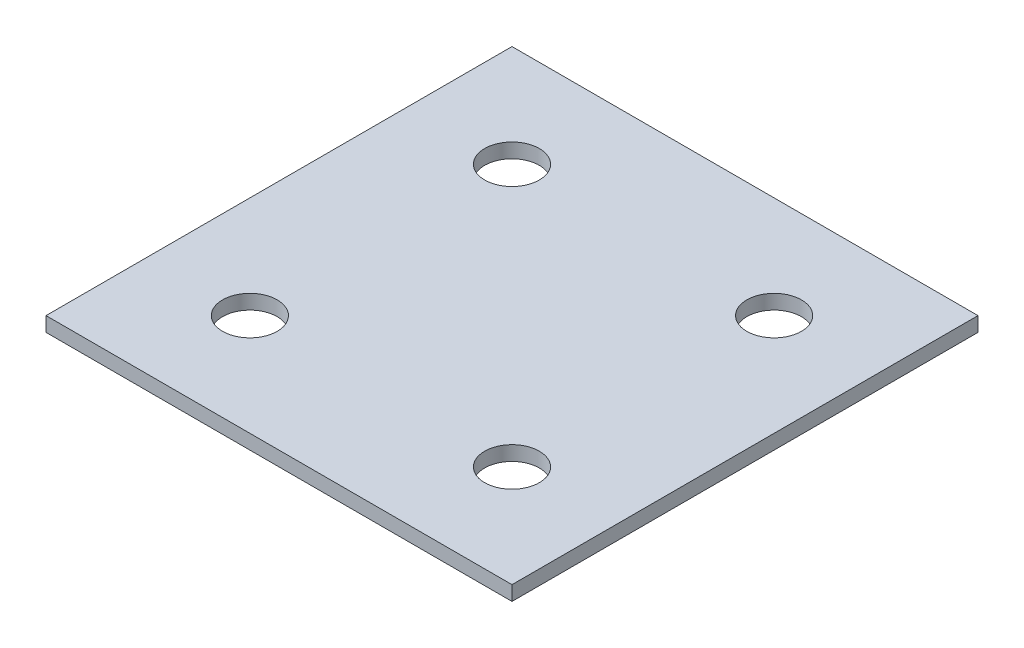
ISO-10303-21;
HEADER;
FILE_DESCRIPTION(('STEP AP214'),'2;1');
FILE_NAME('part.step','',(''),(''),'','','');
FILE_SCHEMA(('AUTOMOTIVE_DESIGN { 1 0 10303 214 1 1 1 1 }'));
ENDSEC;
DATA;
#1=APPLICATION_CONTEXT('core data for automotive mechanical design processes');
#2=APPLICATION_PROTOCOL_DEFINITION('international standard','automotive_design',2000,#1);
#3=PRODUCT_CONTEXT('',#1,'mechanical');
#4=PRODUCT('Part','Part','',(#3));
#5=PRODUCT_RELATED_PRODUCT_CATEGORY('part','',(#4));
#6=PRODUCT_DEFINITION_FORMATION('','',#4);
#7=PRODUCT_DEFINITION_CONTEXT('part definition',#1,'design');
#8=PRODUCT_DEFINITION('design','',#6,#7);
#9=PRODUCT_DEFINITION_SHAPE('','',#8);
#10=(LENGTH_UNIT() NAMED_UNIT(*) SI_UNIT(.MILLI.,.METRE.));
#11=(NAMED_UNIT(*) PLANE_ANGLE_UNIT() SI_UNIT($,.RADIAN.));
#12=(NAMED_UNIT(*) SI_UNIT($,.STERADIAN.) SOLID_ANGLE_UNIT());
#13=UNCERTAINTY_MEASURE_WITH_UNIT(LENGTH_MEASURE(1.E-05),#10,'distance_accuracy_value','');
#14=(GEOMETRIC_REPRESENTATION_CONTEXT(3) GLOBAL_UNCERTAINTY_ASSIGNED_CONTEXT((#13)) GLOBAL_UNIT_ASSIGNED_CONTEXT((#10,
#11,#12)) REPRESENTATION_CONTEXT('',''));
#15=CARTESIAN_POINT('',(0.,0.,0.));
#16=DIRECTION('',(0.,0.,1.));
#17=DIRECTION('',(1.,0.,0.));
#18=AXIS2_PLACEMENT_3D('',#15,#16,#17);
#19=CARTESIAN_POINT('',(0.,6.35,0.));
#20=DIRECTION('',(0.,-1.,0.));
#21=DIRECTION('',(0.,0.,-1.));
#22=AXIS2_PLACEMENT_3D('',#19,#20,#21);
#23=PLANE('',#22);
#24=DIRECTION('',(0.,0.,1.));
#25=VECTOR('',#24,1.);
#26=CARTESIAN_POINT('',(0.,6.35,0.));
#27=LINE('',#26,#25);
#28=CARTESIAN_POINT('',(0.,6.35,-203.2));
#29=VERTEX_POINT('',#28);
#30=CARTESIAN_POINT('',(0.,6.35,0.));
#31=VERTEX_POINT('',#30);
#32=EDGE_CURVE('E94',#29,#31,#27,.T.);
#33=ORIENTED_EDGE('',*,*,#32,.T.);
#34=DIRECTION('',(1.,0.,0.));
#35=VECTOR('',#34,1.);
#36=CARTESIAN_POINT('',(0.,6.35,0.));
#37=LINE('',#36,#35);
#38=CARTESIAN_POINT('',(203.2,6.35,0.));
#39=VERTEX_POINT('',#38);
#40=EDGE_CURVE('E89',#31,#39,#37,.T.);
#41=ORIENTED_EDGE('',*,*,#40,.T.);
#42=DIRECTION('',(0.,0.,-1.));
#43=VECTOR('',#42,1.);
#44=CARTESIAN_POINT('',(203.2,6.35,0.));
#45=LINE('',#44,#43);
#46=CARTESIAN_POINT('',(203.2,6.35,-203.2));
#47=VERTEX_POINT('',#46);
#48=EDGE_CURVE('E92',#39,#47,#45,.T.);
#49=ORIENTED_EDGE('',*,*,#48,.T.);
#50=DIRECTION('',(-1.,0.,0.));
#51=VECTOR('',#50,1.);
#52=CARTESIAN_POINT('',(0.,6.35,-203.2));
#53=LINE('',#52,#51);
#54=EDGE_CURVE('E59',#47,#29,#53,.T.);
#55=ORIENTED_EDGE('',*,*,#54,.T.);
#56=EDGE_LOOP('',(#33,#41,#49,#55));
#57=FACE_BOUND('',#56,.T.);
#58=CARTESIAN_POINT('',(44.45,6.35,-158.75));
#59=DIRECTION('',(0.,1.,0.));
#60=DIRECTION('',(0.,0.,1.));
#61=AXIS2_PLACEMENT_3D('',#58,#59,#60);
#62=CIRCLE('',#61,11.90625);
#63=CARTESIAN_POINT('',(44.45,6.35,-146.84375));
#64=VERTEX_POINT('',#63);
#65=EDGE_CURVE('E116',#64,#64,#62,.T.);
#66=ORIENTED_EDGE('',*,*,#65,.F.);
#67=EDGE_LOOP('',(#66));
#68=FACE_BOUND('',#67,.T.);
#69=CARTESIAN_POINT('',(44.45,6.35,-44.45));
#70=DIRECTION('',(0.,1.,0.));
#71=DIRECTION('',(0.,0.,1.));
#72=AXIS2_PLACEMENT_3D('',#69,#70,#71);
#73=CIRCLE('',#72,11.90625);
#74=CARTESIAN_POINT('',(44.45,6.35,-32.54375));
#75=VERTEX_POINT('',#74);
#76=EDGE_CURVE('E142',#75,#75,#73,.T.);
#77=ORIENTED_EDGE('',*,*,#76,.F.);
#78=EDGE_LOOP('',(#77));
#79=FACE_BOUND('',#78,.T.);
#80=CARTESIAN_POINT('',(158.75,6.35,-158.75));
#81=DIRECTION('',(0.,1.,0.));
#82=DIRECTION('',(0.,0.,1.));
#83=AXIS2_PLACEMENT_3D('',#80,#81,#82);
#84=CIRCLE('',#83,11.90625);
#85=CARTESIAN_POINT('',(158.75,6.35,-146.84375));
#86=VERTEX_POINT('',#85);
#87=EDGE_CURVE('E150',#86,#86,#84,.T.);
#88=ORIENTED_EDGE('',*,*,#87,.F.);
#89=EDGE_LOOP('',(#88));
#90=FACE_BOUND('',#89,.T.);
#91=CARTESIAN_POINT('',(158.75,6.35,-44.45));
#92=DIRECTION('',(0.,1.,0.));
#93=DIRECTION('',(0.,0.,1.));
#94=AXIS2_PLACEMENT_3D('',#91,#92,#93);
#95=CIRCLE('',#94,11.90625);
#96=CARTESIAN_POINT('',(158.75,6.35,-32.54375));
#97=VERTEX_POINT('',#96);
#98=EDGE_CURVE('E158',#97,#97,#95,.T.);
#99=ORIENTED_EDGE('',*,*,#98,.F.);
#100=EDGE_LOOP('',(#99));
#101=FACE_BOUND('',#100,.T.);
#102=ADVANCED_FACE('F41',(#57,#68,#79,#90,#101),#23,.F.);
#103=CARTESIAN_POINT('',(0.,0.,0.));
#104=DIRECTION('',(0.,-1.,0.));
#105=DIRECTION('',(0.,0.,-1.));
#106=AXIS2_PLACEMENT_3D('',#103,#104,#105);
#107=PLANE('',#106);
#108=CARTESIAN_POINT('',(158.75,0.,-158.75));
#109=DIRECTION('',(0.,1.,0.));
#110=DIRECTION('',(0.,0.,1.));
#111=AXIS2_PLACEMENT_3D('',#108,#109,#110);
#112=CIRCLE('',#111,11.90625);
#113=CARTESIAN_POINT('',(158.75,0.,-146.84375));
#114=VERTEX_POINT('',#113);
#115=EDGE_CURVE('E154',#114,#114,#112,.T.);
#116=ORIENTED_EDGE('',*,*,#115,.T.);
#117=EDGE_LOOP('',(#116));
#118=FACE_BOUND('',#117,.T.);
#119=CARTESIAN_POINT('',(44.45,0.,-158.75));
#120=DIRECTION('',(0.,1.,0.));
#121=DIRECTION('',(0.,0.,1.));
#122=AXIS2_PLACEMENT_3D('',#119,#120,#121);
#123=CIRCLE('',#122,11.90625);
#124=CARTESIAN_POINT('',(44.45,0.,-146.84375));
#125=VERTEX_POINT('',#124);
#126=EDGE_CURVE('E138',#125,#125,#123,.T.);
#127=ORIENTED_EDGE('',*,*,#126,.T.);
#128=EDGE_LOOP('',(#127));
#129=FACE_BOUND('',#128,.T.);
#130=DIRECTION('',(0.,0.,1.));
#131=VECTOR('',#130,1.);
#132=CARTESIAN_POINT('',(0.,0.,0.));
#133=LINE('',#132,#131);
#134=CARTESIAN_POINT('',(0.,0.,-203.2));
#135=VERTEX_POINT('',#134);
#136=CARTESIAN_POINT('',(0.,0.,0.));
#137=VERTEX_POINT('',#136);
#138=EDGE_CURVE('E112',#135,#137,#133,.T.);
#139=ORIENTED_EDGE('',*,*,#138,.F.);
#140=DIRECTION('',(-1.,0.,0.));
#141=VECTOR('',#140,1.);
#142=CARTESIAN_POINT('',(0.,0.,-203.2));
#143=LINE('',#142,#141);
#144=CARTESIAN_POINT('',(203.2,0.,-203.2));
#145=VERTEX_POINT('',#144);
#146=EDGE_CURVE('E82',#145,#135,#143,.T.);
#147=ORIENTED_EDGE('',*,*,#146,.F.);
#148=DIRECTION('',(0.,0.,-1.));
#149=VECTOR('',#148,1.);
#150=CARTESIAN_POINT('',(203.2,0.,0.));
#151=LINE('',#150,#149);
#152=CARTESIAN_POINT('',(203.2,0.,0.));
#153=VERTEX_POINT('',#152);
#154=EDGE_CURVE('E76',#153,#145,#151,.T.);
#155=ORIENTED_EDGE('',*,*,#154,.F.);
#156=DIRECTION('',(1.,0.,0.));
#157=VECTOR('',#156,1.);
#158=CARTESIAN_POINT('',(0.,0.,0.));
#159=LINE('',#158,#157);
#160=EDGE_CURVE('E99',#137,#153,#159,.T.);
#161=ORIENTED_EDGE('',*,*,#160,.F.);
#162=EDGE_LOOP('',(#139,#147,#155,#161));
#163=FACE_BOUND('',#162,.T.);
#164=CARTESIAN_POINT('',(44.45,0.,-44.45));
#165=DIRECTION('',(0.,1.,0.));
#166=DIRECTION('',(0.,0.,1.));
#167=AXIS2_PLACEMENT_3D('',#164,#165,#166);
#168=CIRCLE('',#167,11.90625);
#169=CARTESIAN_POINT('',(44.45,0.,-32.54375));
#170=VERTEX_POINT('',#169);
#171=EDGE_CURVE('E146',#170,#170,#168,.T.);
#172=ORIENTED_EDGE('',*,*,#171,.T.);
#173=EDGE_LOOP('',(#172));
#174=FACE_BOUND('',#173,.T.);
#175=CARTESIAN_POINT('',(158.75,0.,-44.45));
#176=DIRECTION('',(0.,1.,0.));
#177=DIRECTION('',(0.,0.,1.));
#178=AXIS2_PLACEMENT_3D('',#175,#176,#177);
#179=CIRCLE('',#178,11.90625);
#180=CARTESIAN_POINT('',(158.75,0.,-32.54375));
#181=VERTEX_POINT('',#180);
#182=EDGE_CURVE('E162',#181,#181,#179,.T.);
#183=ORIENTED_EDGE('',*,*,#182,.T.);
#184=EDGE_LOOP('',(#183));
#185=FACE_BOUND('',#184,.T.);
#186=ADVANCED_FACE('F131',(#118,#129,#163,#174,#185),#107,.T.);
#187=CARTESIAN_POINT('',(0.,6.35,0.));
#188=DIRECTION('',(1.,0.,0.));
#189=DIRECTION('',(0.,0.,-1.));
#190=AXIS2_PLACEMENT_3D('',#187,#188,#189);
#191=PLANE('',#190);
#192=ORIENTED_EDGE('',*,*,#138,.T.);
#193=DIRECTION('',(0.,-1.,0.));
#194=VECTOR('',#193,1.);
#195=CARTESIAN_POINT('',(0.,6.35,0.));
#196=LINE('',#195,#194);
#197=EDGE_CURVE('E11',#31,#137,#196,.T.);
#198=ORIENTED_EDGE('',*,*,#197,.F.);
#199=ORIENTED_EDGE('',*,*,#32,.F.);
#200=DIRECTION('',(0.,-1.,0.));
#201=VECTOR('',#200,1.);
#202=CARTESIAN_POINT('',(0.,6.35,-203.2));
#203=LINE('',#202,#201);
#204=EDGE_CURVE('E108',#29,#135,#203,.T.);
#205=ORIENTED_EDGE('',*,*,#204,.T.);
#206=EDGE_LOOP('',(#192,#198,#199,#205));
#207=FACE_BOUND('',#206,.T.);
#208=ADVANCED_FACE('F43',(#207),#191,.F.);
#209=CARTESIAN_POINT('',(0.,6.35,0.));
#210=DIRECTION('',(0.,0.,-1.));
#211=DIRECTION('',(-1.,0.,0.));
#212=AXIS2_PLACEMENT_3D('',#209,#210,#211);
#213=PLANE('',#212);
#214=ORIENTED_EDGE('',*,*,#160,.T.);
#215=DIRECTION('',(0.,-1.,0.));
#216=VECTOR('',#215,1.);
#217=CARTESIAN_POINT('',(203.2,6.35,0.));
#218=LINE('',#217,#216);
#219=EDGE_CURVE('E51',#39,#153,#218,.T.);
#220=ORIENTED_EDGE('',*,*,#219,.F.);
#221=ORIENTED_EDGE('',*,*,#40,.F.);
#222=ORIENTED_EDGE('',*,*,#197,.T.);
#223=EDGE_LOOP('',(#214,#220,#221,#222));
#224=FACE_BOUND('',#223,.T.);
#225=ADVANCED_FACE('F98',(#224),#213,.F.);
#226=CARTESIAN_POINT('',(203.2,6.35,0.));
#227=DIRECTION('',(-1.,0.,0.));
#228=DIRECTION('',(0.,0.,1.));
#229=AXIS2_PLACEMENT_3D('',#226,#227,#228);
#230=PLANE('',#229);
#231=ORIENTED_EDGE('',*,*,#154,.T.);
#232=DIRECTION('',(0.,-1.,0.));
#233=VECTOR('',#232,1.);
#234=CARTESIAN_POINT('',(203.2,6.35,-203.2));
#235=LINE('',#234,#233);
#236=EDGE_CURVE('E101',#47,#145,#235,.T.);
#237=ORIENTED_EDGE('',*,*,#236,.F.);
#238=ORIENTED_EDGE('',*,*,#48,.F.);
#239=ORIENTED_EDGE('',*,*,#219,.T.);
#240=EDGE_LOOP('',(#231,#237,#238,#239));
#241=FACE_BOUND('',#240,.T.);
#242=ADVANCED_FACE('F102',(#241),#230,.F.);
#243=CARTESIAN_POINT('',(0.,6.35,-203.2));
#244=DIRECTION('',(0.,0.,1.));
#245=DIRECTION('',(1.,0.,0.));
#246=AXIS2_PLACEMENT_3D('',#243,#244,#245);
#247=PLANE('',#246);
#248=ORIENTED_EDGE('',*,*,#146,.T.);
#249=ORIENTED_EDGE('',*,*,#204,.F.);
#250=ORIENTED_EDGE('',*,*,#54,.F.);
#251=ORIENTED_EDGE('',*,*,#236,.T.);
#252=EDGE_LOOP('',(#248,#249,#250,#251));
#253=FACE_BOUND('',#252,.T.);
#254=ADVANCED_FACE('F128',(#253),#247,.F.);
#255=CARTESIAN_POINT('',(44.45,6.35,-158.75));
#256=DIRECTION('',(0.,-1.,0.));
#257=DIRECTION('',(0.,0.,-1.));
#258=AXIS2_PLACEMENT_3D('',#255,#256,#257);
#259=CYLINDRICAL_SURFACE('',#258,11.90625);
#260=ORIENTED_EDGE('',*,*,#65,.T.);
#261=EDGE_LOOP('',(#260));
#262=FACE_BOUND('',#261,.T.);
#263=ORIENTED_EDGE('',*,*,#126,.F.);
#264=EDGE_LOOP('',(#263));
#265=FACE_BOUND('',#264,.T.);
#266=ADVANCED_FACE('F183',(#262,#265),#259,.F.);
#267=CARTESIAN_POINT('',(44.45,6.35,-44.45));
#268=DIRECTION('',(0.,-1.,0.));
#269=DIRECTION('',(0.,0.,-1.));
#270=AXIS2_PLACEMENT_3D('',#267,#268,#269);
#271=CYLINDRICAL_SURFACE('',#270,11.90625);
#272=ORIENTED_EDGE('',*,*,#76,.T.);
#273=EDGE_LOOP('',(#272));
#274=FACE_BOUND('',#273,.T.);
#275=ORIENTED_EDGE('',*,*,#171,.F.);
#276=EDGE_LOOP('',(#275));
#277=FACE_BOUND('',#276,.T.);
#278=ADVANCED_FACE('F238',(#274,#277),#271,.F.);
#279=CARTESIAN_POINT('',(158.75,6.35,-158.75));
#280=DIRECTION('',(0.,-1.,0.));
#281=DIRECTION('',(0.,0.,-1.));
#282=AXIS2_PLACEMENT_3D('',#279,#280,#281);
#283=CYLINDRICAL_SURFACE('',#282,11.90625);
#284=ORIENTED_EDGE('',*,*,#87,.T.);
#285=EDGE_LOOP('',(#284));
#286=FACE_BOUND('',#285,.T.);
#287=ORIENTED_EDGE('',*,*,#115,.F.);
#288=EDGE_LOOP('',(#287));
#289=FACE_BOUND('',#288,.T.);
#290=ADVANCED_FACE('F247',(#286,#289),#283,.F.);
#291=CARTESIAN_POINT('',(158.75,6.35,-44.45));
#292=DIRECTION('',(0.,-1.,0.));
#293=DIRECTION('',(0.,0.,-1.));
#294=AXIS2_PLACEMENT_3D('',#291,#292,#293);
#295=CYLINDRICAL_SURFACE('',#294,11.90625);
#296=ORIENTED_EDGE('',*,*,#98,.T.);
#297=EDGE_LOOP('',(#296));
#298=FACE_BOUND('',#297,.T.);
#299=ORIENTED_EDGE('',*,*,#182,.F.);
#300=EDGE_LOOP('',(#299));
#301=FACE_BOUND('',#300,.T.);
#302=ADVANCED_FACE('F172',(#298,#301),#295,.F.);
#303=CLOSED_SHELL('',(#102,#186,#208,#225,#242,#254,#266,#278,#290,#302));
#304=MANIFOLD_SOLID_BREP('B2',#303);
#305=ADVANCED_BREP_SHAPE_REPRESENTATION('',(#18,#304),#14);
#306=SHAPE_DEFINITION_REPRESENTATION(#9,#305);
ENDSEC;
END-ISO-10303-21;
